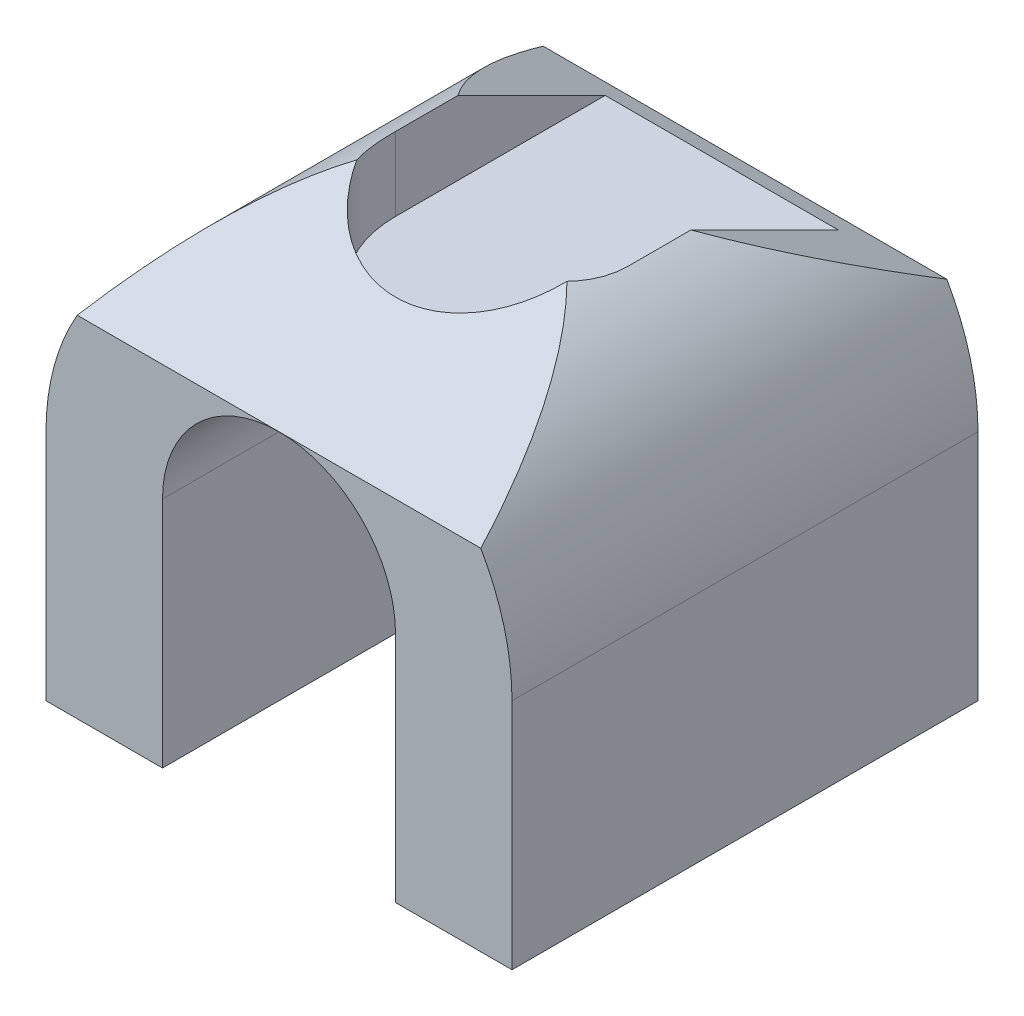
ISO-10303-21;
HEADER;
FILE_DESCRIPTION(('STEP AP214'),'2;1');
FILE_NAME('part.step','',(''),(''),'','','');
FILE_SCHEMA(('AUTOMOTIVE_DESIGN { 1 0 10303 214 1 1 1 1 }'));
ENDSEC;
DATA;
#1=APPLICATION_CONTEXT('core data for automotive mechanical design processes');
#2=APPLICATION_PROTOCOL_DEFINITION('international standard','automotive_design',2000,#1);
#3=PRODUCT_CONTEXT('',#1,'mechanical');
#4=PRODUCT('Part','Part','',(#3));
#5=PRODUCT_RELATED_PRODUCT_CATEGORY('part','',(#4));
#6=PRODUCT_DEFINITION_FORMATION('','',#4);
#7=PRODUCT_DEFINITION_CONTEXT('part definition',#1,'design');
#8=PRODUCT_DEFINITION('design','',#6,#7);
#9=PRODUCT_DEFINITION_SHAPE('','',#8);
#10=(LENGTH_UNIT() NAMED_UNIT(*) SI_UNIT(.MILLI.,.METRE.));
#11=(NAMED_UNIT(*) PLANE_ANGLE_UNIT() SI_UNIT($,.RADIAN.));
#12=(NAMED_UNIT(*) SI_UNIT($,.STERADIAN.) SOLID_ANGLE_UNIT());
#13=UNCERTAINTY_MEASURE_WITH_UNIT(LENGTH_MEASURE(1.E-05),#10,'distance_accuracy_value','');
#14=(GEOMETRIC_REPRESENTATION_CONTEXT(3) GLOBAL_UNCERTAINTY_ASSIGNED_CONTEXT((#13)) GLOBAL_UNIT_ASSIGNED_CONTEXT((#10,
#11,#12)) REPRESENTATION_CONTEXT('',''));
#15=CARTESIAN_POINT('',(0.,0.,0.));
#16=DIRECTION('',(0.,0.,1.));
#17=DIRECTION('',(1.,0.,0.));
#18=AXIS2_PLACEMENT_3D('',#15,#16,#17);
#19=CARTESIAN_POINT('',(-2.,4.,-2.));
#20=DIRECTION('',(0.,0.,1.));
#21=DIRECTION('',(1.,0.,0.));
#22=AXIS2_PLACEMENT_3D('',#19,#20,#21);
#23=PLANE('',#22);
#24=DIRECTION('',(0.,-1.,0.));
#25=VECTOR('',#24,1.);
#26=CARTESIAN_POINT('',(-2.,4.,-2.));
#27=LINE('',#26,#25);
#28=CARTESIAN_POINT('',(-2.,2.,-2.));
#29=VERTEX_POINT('',#28);
#30=CARTESIAN_POINT('',(-2.,0.,-2.));
#31=VERTEX_POINT('',#30);
#32=EDGE_CURVE('E343',#29,#31,#27,.T.);
#33=ORIENTED_EDGE('',*,*,#32,.F.);
#34=CARTESIAN_POINT('',(0.,2.,-2.));
#35=DIRECTION('',(0.,0.,1.));
#36=DIRECTION('',(1.,0.,0.));
#37=AXIS2_PLACEMENT_3D('',#34,#35,#36);
#38=CIRCLE('',#37,2.);
#39=CARTESIAN_POINT('',(-1.73205080756888,3.,-2.));
#40=VERTEX_POINT('',#39);
#41=EDGE_CURVE('E284',#29,#40,#38,.F.);
#42=ORIENTED_EDGE('',*,*,#41,.T.);
#43=DIRECTION('',(-1.,0.,0.));
#44=VECTOR('',#43,1.);
#45=CARTESIAN_POINT('',(8.,3.,-2.));
#46=LINE('',#45,#44);
#47=CARTESIAN_POINT('',(0.,3.,-2.));
#48=VERTEX_POINT('',#47);
#49=EDGE_CURVE('E321',#48,#40,#46,.T.);
#50=ORIENTED_EDGE('',*,*,#49,.F.);
#51=CARTESIAN_POINT('',(0.,2.,-2.));
#52=DIRECTION('',(0.,0.,1.));
#53=DIRECTION('',(1.,0.,0.));
#54=AXIS2_PLACEMENT_3D('',#51,#52,#53);
#55=CIRCLE('',#54,1.);
#56=CARTESIAN_POINT('',(-1.,2.,-2.));
#57=VERTEX_POINT('',#56);
#58=EDGE_CURVE('E304',#48,#57,#55,.T.);
#59=ORIENTED_EDGE('',*,*,#58,.T.);
#60=DIRECTION('',(0.,1.,0.));
#61=VECTOR('',#60,1.);
#62=CARTESIAN_POINT('',(-1.,4.,-2.));
#63=LINE('',#62,#61);
#64=CARTESIAN_POINT('',(-1.,0.,-2.));
#65=VERTEX_POINT('',#64);
#66=EDGE_CURVE('E313',#65,#57,#63,.T.);
#67=ORIENTED_EDGE('',*,*,#66,.F.);
#68=DIRECTION('',(-1.,0.,0.));
#69=VECTOR('',#68,1.);
#70=CARTESIAN_POINT('',(-2.,0.,-2.));
#71=LINE('',#70,#69);
#72=EDGE_CURVE('E328',#65,#31,#71,.T.);
#73=ORIENTED_EDGE('',*,*,#72,.T.);
#74=EDGE_LOOP('',(#33,#42,#50,#59,#67,#73));
#75=FACE_BOUND('',#74,.T.);
#76=ADVANCED_FACE('F93',(#75),#23,.F.);
#77=CARTESIAN_POINT('',(-2.,4.,2.));
#78=DIRECTION('',(0.,0.,-1.));
#79=DIRECTION('',(-1.,0.,0.));
#80=AXIS2_PLACEMENT_3D('',#77,#78,#79);
#81=PLANE('',#80);
#82=DIRECTION('',(-1.,0.,0.));
#83=VECTOR('',#82,1.);
#84=CARTESIAN_POINT('',(8.,3.,2.));
#85=LINE('',#84,#83);
#86=CARTESIAN_POINT('',(0.,3.,2.));
#87=VERTEX_POINT('',#86);
#88=CARTESIAN_POINT('',(-1.73205080756888,3.,2.));
#89=VERTEX_POINT('',#88);
#90=EDGE_CURVE('E318',#87,#89,#85,.T.);
#91=ORIENTED_EDGE('',*,*,#90,.T.);
#92=CARTESIAN_POINT('',(0.,2.,2.));
#93=DIRECTION('',(0.,0.,1.));
#94=DIRECTION('',(1.,0.,0.));
#95=AXIS2_PLACEMENT_3D('',#92,#93,#94);
#96=CIRCLE('',#95,2.);
#97=CARTESIAN_POINT('',(-2.,2.,2.));
#98=VERTEX_POINT('',#97);
#99=EDGE_CURVE('E275',#98,#89,#96,.F.);
#100=ORIENTED_EDGE('',*,*,#99,.F.);
#101=DIRECTION('',(0.,-1.,0.));
#102=VECTOR('',#101,1.);
#103=CARTESIAN_POINT('',(-2.,4.,2.));
#104=LINE('',#103,#102);
#105=CARTESIAN_POINT('',(-2.,0.,2.));
#106=VERTEX_POINT('',#105);
#107=EDGE_CURVE('E341',#98,#106,#104,.T.);
#108=ORIENTED_EDGE('',*,*,#107,.T.);
#109=DIRECTION('',(1.,0.,0.));
#110=VECTOR('',#109,1.);
#111=CARTESIAN_POINT('',(-2.,0.,2.));
#112=LINE('',#111,#110);
#113=CARTESIAN_POINT('',(-1.,0.,2.));
#114=VERTEX_POINT('',#113);
#115=EDGE_CURVE('E336',#106,#114,#112,.T.);
#116=ORIENTED_EDGE('',*,*,#115,.T.);
#117=DIRECTION('',(0.,1.,0.));
#118=VECTOR('',#117,1.);
#119=CARTESIAN_POINT('',(-1.,0.,2.));
#120=LINE('',#119,#118);
#121=CARTESIAN_POINT('',(-1.,2.,2.));
#122=VERTEX_POINT('',#121);
#123=EDGE_CURVE('E298',#114,#122,#120,.T.);
#124=ORIENTED_EDGE('',*,*,#123,.T.);
#125=CARTESIAN_POINT('',(0.,2.,2.));
#126=DIRECTION('',(0.,0.,1.));
#127=DIRECTION('',(1.,0.,0.));
#128=AXIS2_PLACEMENT_3D('',#125,#126,#127);
#129=CIRCLE('',#128,1.);
#130=EDGE_CURVE('E295',#87,#122,#129,.T.);
#131=ORIENTED_EDGE('',*,*,#130,.F.);
#132=EDGE_LOOP('',(#91,#100,#108,#116,#124,#131));
#133=FACE_BOUND('',#132,.T.);
#134=ADVANCED_FACE('F366',(#133),#81,.F.);
#135=CARTESIAN_POINT('',(8.,3.2,-1.6));
#136=DIRECTION('',(0.,-0.894427190999916,0.447213595499958));
#137=DIRECTION('',(0.,-0.447213595499958,-0.894427190999916));
#138=AXIS2_PLACEMENT_3D('',#135,#136,#137);
#139=PLANE('',#138);
#140=CARTESIAN_POINT('',(0.,2.,-4.));
#141=DIRECTION('',(0.,-0.894427190999916,0.447213595499958));
#142=DIRECTION('',(0.,0.447213595499958,0.894427190999916));
#143=AXIS2_PLACEMENT_3D('',#140,#141,#142);
#144=ELLIPSE('',#143,4.47213595499958,2.);
#145=CARTESIAN_POINT('',(-1.,3.73205080756888,-0.535898384862244));
#146=VERTEX_POINT('',#145);
#147=EDGE_CURVE('E280',#40,#146,#144,.F.);
#148=ORIENTED_EDGE('',*,*,#147,.T.);
#149=DIRECTION('',(0.,-0.447213595499958,-0.894427190999916));
#150=VECTOR('',#149,1.);
#151=CARTESIAN_POINT('',(-1.,3.2,-1.6));
#152=LINE('',#151,#150);
#153=CARTESIAN_POINT('',(-1.,3.1,-1.8));
#154=VERTEX_POINT('',#153);
#155=EDGE_CURVE('E108',#146,#154,#152,.T.);
#156=ORIENTED_EDGE('',*,*,#155,.T.);
#157=DIRECTION('',(-1.,0.,0.));
#158=VECTOR('',#157,1.);
#159=CARTESIAN_POINT('',(8.,3.1,-1.8));
#160=LINE('',#159,#158);
#161=CARTESIAN_POINT('',(1.,3.1,-1.8));
#162=VERTEX_POINT('',#161);
#163=EDGE_CURVE('E12',#162,#154,#160,.T.);
#164=ORIENTED_EDGE('',*,*,#163,.F.);
#165=DIRECTION('',(0.,0.447213595499958,0.894427190999916));
#166=VECTOR('',#165,1.);
#167=CARTESIAN_POINT('',(1.,3.2,-1.6));
#168=LINE('',#167,#166);
#169=CARTESIAN_POINT('',(1.,3.73205080756888,-0.535898384862246));
#170=VERTEX_POINT('',#169);
#171=EDGE_CURVE('E225',#162,#170,#168,.T.);
#172=ORIENTED_EDGE('',*,*,#171,.T.);
#173=CARTESIAN_POINT('',(0.,2.,-4.));
#174=DIRECTION('',(0.,-0.894427190999916,0.447213595499958));
#175=DIRECTION('',(0.,0.447213595499958,0.894427190999916));
#176=AXIS2_PLACEMENT_3D('',#173,#174,#175);
#177=ELLIPSE('',#176,4.47213595499958,2.);
#178=CARTESIAN_POINT('',(1.73205080756888,3.,-2.));
#179=VERTEX_POINT('',#178);
#180=EDGE_CURVE('E270',#170,#179,#177,.F.);
#181=ORIENTED_EDGE('',*,*,#180,.T.);
#182=EDGE_CURVE('E324',#179,#48,#46,.T.);
#183=ORIENTED_EDGE('',*,*,#182,.T.);
#184=ORIENTED_EDGE('',*,*,#49,.T.);
#185=EDGE_LOOP('',(#148,#156,#164,#172,#181,#183,#184));
#186=FACE_BOUND('',#185,.T.);
#187=ADVANCED_FACE('F273',(#186),#139,.F.);
#188=CARTESIAN_POINT('',(2.,4.,2.));
#189=DIRECTION('',(-1.,0.,0.));
#190=DIRECTION('',(0.,0.,1.));
#191=AXIS2_PLACEMENT_3D('',#188,#189,#190);
#192=PLANE('',#191);
#193=DIRECTION('',(0.,0.,1.));
#194=VECTOR('',#193,1.);
#195=CARTESIAN_POINT('',(2.,2.,-8.));
#196=LINE('',#195,#194);
#197=CARTESIAN_POINT('',(2.,2.,-2.));
#198=VERTEX_POINT('',#197);
#199=CARTESIAN_POINT('',(2.,2.,2.));
#200=VERTEX_POINT('',#199);
#201=EDGE_CURVE('E289',#198,#200,#196,.T.);
#202=ORIENTED_EDGE('',*,*,#201,.T.);
#203=DIRECTION('',(0.,-1.,0.));
#204=VECTOR('',#203,1.);
#205=CARTESIAN_POINT('',(2.,4.,2.));
#206=LINE('',#205,#204);
#207=CARTESIAN_POINT('',(2.,0.,2.));
#208=VERTEX_POINT('',#207);
#209=EDGE_CURVE('E339',#200,#208,#206,.T.);
#210=ORIENTED_EDGE('',*,*,#209,.T.);
#211=DIRECTION('',(0.,0.,-1.));
#212=VECTOR('',#211,1.);
#213=CARTESIAN_POINT('',(2.,0.,2.));
#214=LINE('',#213,#212);
#215=CARTESIAN_POINT('',(2.,0.,-2.));
#216=VERTEX_POINT('',#215);
#217=EDGE_CURVE('E325',#208,#216,#214,.T.);
#218=ORIENTED_EDGE('',*,*,#217,.T.);
#219=DIRECTION('',(0.,-1.,0.));
#220=VECTOR('',#219,1.);
#221=CARTESIAN_POINT('',(2.,4.,-2.));
#222=LINE('',#221,#220);
#223=EDGE_CURVE('E345',#198,#216,#222,.T.);
#224=ORIENTED_EDGE('',*,*,#223,.F.);
#225=EDGE_LOOP('',(#202,#210,#218,#224));
#226=FACE_BOUND('',#225,.T.);
#227=ADVANCED_FACE('F95',(#226),#192,.F.);
#228=CARTESIAN_POINT('',(0.,0.,0.));
#229=DIRECTION('',(0.,-1.,0.));
#230=DIRECTION('',(0.,0.,-1.));
#231=AXIS2_PLACEMENT_3D('',#228,#229,#230);
#232=PLANE('',#231);
#233=ORIENTED_EDGE('',*,*,#72,.F.);
#234=DIRECTION('',(0.,0.,1.));
#235=VECTOR('',#234,1.);
#236=CARTESIAN_POINT('',(-1.,0.,0.));
#237=LINE('',#236,#235);
#238=EDGE_CURVE('E349',#65,#114,#237,.T.);
#239=ORIENTED_EDGE('',*,*,#238,.T.);
#240=ORIENTED_EDGE('',*,*,#115,.F.);
#241=DIRECTION('',(0.,0.,1.));
#242=VECTOR('',#241,1.);
#243=CARTESIAN_POINT('',(-2.,0.,2.));
#244=LINE('',#243,#242);
#245=EDGE_CURVE('E332',#31,#106,#244,.T.);
#246=ORIENTED_EDGE('',*,*,#245,.F.);
#247=EDGE_LOOP('',(#233,#239,#240,#246));
#248=FACE_BOUND('',#247,.T.);
#249=ADVANCED_FACE('F400',(#248),#232,.T.);
#250=ORIENTED_EDGE('',*,*,#182,.F.);
#251=CARTESIAN_POINT('',(0.,2.,-2.));
#252=DIRECTION('',(0.,0.,1.));
#253=DIRECTION('',(1.,0.,0.));
#254=AXIS2_PLACEMENT_3D('',#251,#252,#253);
#255=CIRCLE('',#254,2.);
#256=EDGE_CURVE('E310',#179,#198,#255,.F.);
#257=ORIENTED_EDGE('',*,*,#256,.T.);
#258=ORIENTED_EDGE('',*,*,#223,.T.);
#259=CARTESIAN_POINT('',(1.,0.,-2.));
#260=VERTEX_POINT('',#259);
#261=EDGE_CURVE('E329',#216,#260,#71,.T.);
#262=ORIENTED_EDGE('',*,*,#261,.T.);
#263=DIRECTION('',(0.,1.,0.));
#264=VECTOR('',#263,1.);
#265=CARTESIAN_POINT('',(0.999999999999998,4.,-2.));
#266=LINE('',#265,#264);
#267=CARTESIAN_POINT('',(0.999999999999999,2.,-2.));
#268=VERTEX_POINT('',#267);
#269=EDGE_CURVE('E315',#260,#268,#266,.T.);
#270=ORIENTED_EDGE('',*,*,#269,.T.);
#271=EDGE_CURVE('E308',#268,#48,#55,.T.);
#272=ORIENTED_EDGE('',*,*,#271,.T.);
#273=EDGE_LOOP('',(#250,#257,#258,#262,#270,#272));
#274=FACE_BOUND('',#273,.T.);
#275=ADVANCED_FACE('F384',(#274),#23,.F.);
#276=CARTESIAN_POINT('',(-2.,4.,2.));
#277=DIRECTION('',(1.,0.,0.));
#278=DIRECTION('',(0.,0.,-1.));
#279=AXIS2_PLACEMENT_3D('',#276,#277,#278);
#280=PLANE('',#279);
#281=ORIENTED_EDGE('',*,*,#107,.F.);
#282=DIRECTION('',(0.,0.,1.));
#283=VECTOR('',#282,1.);
#284=CARTESIAN_POINT('',(-2.,2.,-8.));
#285=LINE('',#284,#283);
#286=EDGE_CURVE('E276',#29,#98,#285,.T.);
#287=ORIENTED_EDGE('',*,*,#286,.F.);
#288=ORIENTED_EDGE('',*,*,#32,.T.);
#289=ORIENTED_EDGE('',*,*,#245,.T.);
#290=EDGE_LOOP('',(#281,#287,#288,#289));
#291=FACE_BOUND('',#290,.T.);
#292=ADVANCED_FACE('F362',(#291),#280,.F.);
#293=ORIENTED_EDGE('',*,*,#209,.F.);
#294=CARTESIAN_POINT('',(0.,2.,2.));
#295=DIRECTION('',(0.,0.,1.));
#296=DIRECTION('',(1.,0.,0.));
#297=AXIS2_PLACEMENT_3D('',#294,#295,#296);
#298=CIRCLE('',#297,2.);
#299=CARTESIAN_POINT('',(1.73205080756888,3.,2.));
#300=VERTEX_POINT('',#299);
#301=EDGE_CURVE('E287',#300,#200,#298,.F.);
#302=ORIENTED_EDGE('',*,*,#301,.F.);
#303=EDGE_CURVE('E320',#300,#87,#85,.T.);
#304=ORIENTED_EDGE('',*,*,#303,.T.);
#305=CARTESIAN_POINT('',(0.999999999999999,2.,2.));
#306=VERTEX_POINT('',#305);
#307=EDGE_CURVE('E296',#306,#87,#129,.T.);
#308=ORIENTED_EDGE('',*,*,#307,.F.);
#309=DIRECTION('',(0.,1.,0.));
#310=VECTOR('',#309,1.);
#311=CARTESIAN_POINT('',(1.,0.,2.));
#312=LINE('',#311,#310);
#313=CARTESIAN_POINT('',(1.,0.,2.));
#314=VERTEX_POINT('',#313);
#315=EDGE_CURVE('E292',#314,#306,#312,.T.);
#316=ORIENTED_EDGE('',*,*,#315,.F.);
#317=EDGE_CURVE('E335',#314,#208,#112,.T.);
#318=ORIENTED_EDGE('',*,*,#317,.T.);
#319=EDGE_LOOP('',(#293,#302,#304,#308,#316,#318));
#320=FACE_BOUND('',#319,.T.);
#321=ADVANCED_FACE('F376',(#320),#81,.F.);
#322=DIRECTION('',(0.,0.,1.));
#323=VECTOR('',#322,1.);
#324=CARTESIAN_POINT('',(1.,0.,0.));
#325=LINE('',#324,#323);
#326=EDGE_CURVE('E352',#260,#314,#325,.T.);
#327=ORIENTED_EDGE('',*,*,#326,.F.);
#328=ORIENTED_EDGE('',*,*,#261,.F.);
#329=ORIENTED_EDGE('',*,*,#217,.F.);
#330=ORIENTED_EDGE('',*,*,#317,.F.);
#331=EDGE_LOOP('',(#327,#328,#329,#330));
#332=FACE_BOUND('',#331,.T.);
#333=ADVANCED_FACE('F387',(#332),#232,.T.);
#334=CARTESIAN_POINT('',(8.,3.2,1.6));
#335=DIRECTION('',(0.,-0.894427190999916,-0.447213595499958));
#336=DIRECTION('',(0.,0.447213595499958,-0.894427190999916));
#337=AXIS2_PLACEMENT_3D('',#334,#335,#336);
#338=PLANE('',#337);
#339=CARTESIAN_POINT('',(0.,2.,4.));
#340=DIRECTION('',(0.,-0.894427190999916,-0.447213595499958));
#341=DIRECTION('',(0.,-0.447213595499958,0.894427190999916));
#342=AXIS2_PLACEMENT_3D('',#339,#340,#341);
#343=ELLIPSE('',#342,4.47213595499958,2.);
#344=CARTESIAN_POINT('',(0.902590160287692,3.78474956297847,0.430500874043064));
#345=VERTEX_POINT('',#344);
#346=EDGE_CURVE('E347',#300,#345,#343,.F.);
#347=ORIENTED_EDGE('',*,*,#346,.T.);
#348=CARTESIAN_POINT('',(0.,4.,0.));
#349=DIRECTION('',(0.,-0.894427190999916,-0.447213595499958));
#350=DIRECTION('',(0.,0.447213595499958,-0.894427190999916));
#351=AXIS2_PLACEMENT_3D('',#348,#349,#350);
#352=ELLIPSE('',#351,1.11803398874989,1.);
#353=CARTESIAN_POINT('',(-0.902590160287692,3.78474956297847,0.430500874043061));
#354=VERTEX_POINT('',#353);
#355=EDGE_CURVE('E236',#345,#354,#352,.T.);
#356=ORIENTED_EDGE('',*,*,#355,.T.);
#357=CARTESIAN_POINT('',(0.,2.,4.));
#358=DIRECTION('',(0.,-0.894427190999916,-0.447213595499958));
#359=DIRECTION('',(0.,-0.447213595499958,0.894427190999916));
#360=AXIS2_PLACEMENT_3D('',#357,#358,#359);
#361=ELLIPSE('',#360,4.47213595499958,2.);
#362=EDGE_CURVE('E116',#354,#89,#361,.F.);
#363=ORIENTED_EDGE('',*,*,#362,.T.);
#364=ORIENTED_EDGE('',*,*,#90,.F.);
#365=ORIENTED_EDGE('',*,*,#303,.F.);
#366=EDGE_LOOP('',(#347,#356,#363,#364,#365));
#367=FACE_BOUND('',#366,.T.);
#368=ADVANCED_FACE('F371',(#367),#338,.F.);
#369=CARTESIAN_POINT('',(0.,2.,-8.));
#370=DIRECTION('',(0.,0.,1.));
#371=DIRECTION('',(1.,0.,0.));
#372=AXIS2_PLACEMENT_3D('',#369,#370,#371);
#373=CYLINDRICAL_SURFACE('',#372,2.);
#374=DIRECTION('',(0.,0.,1.));
#375=VECTOR('',#374,1.);
#376=CARTESIAN_POINT('',(1.,3.73205080756888,-8.));
#377=LINE('',#376,#375);
#378=CARTESIAN_POINT('',(1.,3.73205080756888,0.));
#379=VERTEX_POINT('',#378);
#380=EDGE_CURVE('E101',#170,#379,#377,.T.);
#381=ORIENTED_EDGE('',*,*,#380,.T.);
#382=CARTESIAN_POINT('',(1.,3.73205080756888,0.));
#383=CARTESIAN_POINT('',(1.00000195137527,3.73204560547661,0.0261972520352561));
#384=CARTESIAN_POINT('',(0.998969890365785,3.73264589074899,0.0523796193393224));
#385=CARTESIAN_POINT('',(0.994866582729859,3.73500693547265,0.10451562976441));
#386=CARTESIAN_POINT('',(0.991796589375349,3.73676698169817,0.130469403530703));
#387=CARTESIAN_POINT('',(0.979625421921302,3.74368133316507,0.207394147212922));
#388=CARTESIAN_POINT('',(0.967562154832119,3.75047121792653,0.257783077372897));
#389=CARTESIAN_POINT('',(0.936112148255902,3.76748616839516,0.355424985722331));
#390=CARTESIAN_POINT('',(0.916740149961811,3.77770431497795,0.402684052566709));
#391=CARTESIAN_POINT('',(0.871308099714303,3.80040740132325,0.493353593991553));
#392=CARTESIAN_POINT('',(0.845237343062601,3.81289595980251,0.536757757599596));
#393=CARTESIAN_POINT('',(0.784663080693048,3.83997018247363,0.622311546260746));
#394=CARTESIAN_POINT('',(0.749644406172151,3.8546438235589,0.664068491857542));
#395=CARTESIAN_POINT('',(0.673244776834064,3.88372298199301,0.74141589913186));
#396=CARTESIAN_POINT('',(0.631862045520576,3.89812842321248,0.77700463306393));
#397=CARTESIAN_POINT('',(0.540469897884267,3.92622083061797,0.843381512931065));
#398=CARTESIAN_POINT('',(0.490065310362353,3.93979240973207,0.873678944594266));
#399=CARTESIAN_POINT('',(0.384109834198184,3.96351616676258,0.925158968529046));
#400=CARTESIAN_POINT('',(0.328566613407682,3.97367333795893,0.946354883694276));
#401=CARTESIAN_POINT('',(0.224523798990683,3.98791771461899,0.97567818472854));
#402=CARTESIAN_POINT('',(0.176606359393242,3.99277751337371,0.985491669279944));
#403=CARTESIAN_POINT('',(0.103829958620148,3.99745240237257,0.994898234871283));
#404=CARTESIAN_POINT('',(0.0793722359955009,3.99857451325701,0.99714730508048));
#405=CARTESIAN_POINT('',(0.0303227514611769,3.99992108024093,0.999842181649924));
#406=CARTESIAN_POINT('',(0.00573093692192345,4.00014515399516,1.00028721993255));
#407=CARTESIAN_POINT('',(-0.018849276866289,3.9999111742179,0.999822336598667));
#408=B_SPLINE_CURVE_WITH_KNOTS('',3,(#382,#383,#384,#385,#386,#387,#388,#389,#390,#391,#392,
#393,#394,#395,#396,#397,#398,#399,#400,#401,#402,#403,#404,#405,#406,#407),.UNSPECIFIED.,.F.,
.F.,(4,2,2,2,2,2,2,2,2,2,2,2,4),(0.,0.0785362457848689,0.157024238642518,0.312951878705677,
0.468566690605075,0.624431740457373,0.793039657549001,0.961694726461857,1.1418133008816,
1.32166730954749,1.46845894528665,1.54214451358215,1.61586145066592),.UNSPECIFIED.);
#409=EDGE_CURVE('E215',#379,#345,#408,.T.);
#410=ORIENTED_EDGE('',*,*,#409,.T.);
#411=ORIENTED_EDGE('',*,*,#346,.F.);
#412=ORIENTED_EDGE('',*,*,#301,.T.);
#413=ORIENTED_EDGE('',*,*,#201,.F.);
#414=ORIENTED_EDGE('',*,*,#256,.F.);
#415=ORIENTED_EDGE('',*,*,#180,.F.);
#416=EDGE_LOOP('',(#381,#410,#411,#412,#413,#414,#415));
#417=FACE_BOUND('',#416,.T.);
#418=ADVANCED_FACE('F245',(#417),#373,.T.);
#419=CARTESIAN_POINT('',(1.,0.,-8.));
#420=DIRECTION('',(1.,0.,0.));
#421=DIRECTION('',(0.,1.,0.));
#422=AXIS2_PLACEMENT_3D('',#419,#420,#421);
#423=PLANE('',#422);
#424=ORIENTED_EDGE('',*,*,#326,.T.);
#425=ORIENTED_EDGE('',*,*,#315,.T.);
#426=DIRECTION('',(0.,0.,1.));
#427=VECTOR('',#426,1.);
#428=CARTESIAN_POINT('',(0.999999999999999,2.,-8.));
#429=LINE('',#428,#427);
#430=EDGE_CURVE('E301',#268,#306,#429,.T.);
#431=ORIENTED_EDGE('',*,*,#430,.F.);
#432=ORIENTED_EDGE('',*,*,#269,.F.);
#433=EDGE_LOOP('',(#424,#425,#431,#432));
#434=FACE_BOUND('',#433,.T.);
#435=ADVANCED_FACE('F390',(#434),#423,.F.);
#436=CARTESIAN_POINT('',(-1.,0.,-8.));
#437=DIRECTION('',(1.,0.,0.));
#438=DIRECTION('',(0.,1.,0.));
#439=AXIS2_PLACEMENT_3D('',#436,#437,#438);
#440=PLANE('',#439);
#441=ORIENTED_EDGE('',*,*,#66,.T.);
#442=DIRECTION('',(0.,0.,1.));
#443=VECTOR('',#442,1.);
#444=CARTESIAN_POINT('',(-1.,2.,-8.));
#445=LINE('',#444,#443);
#446=EDGE_CURVE('E302',#57,#122,#445,.T.);
#447=ORIENTED_EDGE('',*,*,#446,.T.);
#448=ORIENTED_EDGE('',*,*,#123,.F.);
#449=ORIENTED_EDGE('',*,*,#238,.F.);
#450=EDGE_LOOP('',(#441,#447,#448,#449));
#451=FACE_BOUND('',#450,.T.);
#452=ADVANCED_FACE('F397',(#451),#440,.T.);
#453=CARTESIAN_POINT('',(0.,2.,-8.));
#454=DIRECTION('',(0.,0.,1.));
#455=DIRECTION('',(1.,0.,0.));
#456=AXIS2_PLACEMENT_3D('',#453,#454,#455);
#457=CYLINDRICAL_SURFACE('',#456,1.);
#458=ORIENTED_EDGE('',*,*,#430,.T.);
#459=ORIENTED_EDGE('',*,*,#307,.T.);
#460=ORIENTED_EDGE('',*,*,#130,.T.);
#461=ORIENTED_EDGE('',*,*,#446,.F.);
#462=ORIENTED_EDGE('',*,*,#58,.F.);
#463=ORIENTED_EDGE('',*,*,#271,.F.);
#464=EDGE_LOOP('',(#458,#459,#460,#461,#462,#463));
#465=FACE_BOUND('',#464,.T.);
#466=ADVANCED_FACE('F394',(#465),#457,.F.);
#467=CARTESIAN_POINT('',(0.,2.,-8.));
#468=DIRECTION('',(0.,0.,1.));
#469=DIRECTION('',(1.,0.,0.));
#470=AXIS2_PLACEMENT_3D('',#467,#468,#469);
#471=CYLINDRICAL_SURFACE('',#470,2.);
#472=ORIENTED_EDGE('',*,*,#362,.F.);
#473=CARTESIAN_POINT('',(0.0188492768662874,3.9999111742179,0.999822336598667));
#474=CARTESIAN_POINT('',(-0.0074365042730844,4.00016157321062,1.00031927050714));
#475=CARTESIAN_POINT('',(-0.0337332138567843,3.99988790373493,0.999775953163634));
#476=CARTESIAN_POINT('',(-0.0861624959720326,3.99831481998451,0.996627066975756));
#477=CARTESIAN_POINT('',(-0.112295125398594,3.99701578360206,0.994022257879792));
#478=CARTESIAN_POINT('',(-0.189918612850001,3.99163319485549,0.983181255175342));
#479=CARTESIAN_POINT('',(-0.240920786729468,3.98606631309525,0.971923311837361));
#480=CARTESIAN_POINT('',(-0.340021215789718,3.97152214149368,0.941844275945984));
#481=CARTESIAN_POINT('',(-0.388122246911061,3.9625481736797,0.923030549514155));
#482=CARTESIAN_POINT('',(-0.480461174145418,3.94200850510889,0.878514022750611));
#483=CARTESIAN_POINT('',(-0.524695355935765,3.93044034969716,0.85280469316077));
#484=CARTESIAN_POINT('',(-0.61083321553593,3.90499720243754,0.793580261804522));
#485=CARTESIAN_POINT('',(-0.652459680848192,3.89102821795682,0.759703326742522));
#486=CARTESIAN_POINT('',(-0.729722278563864,3.86257978441686,0.685832226428549));
#487=CARTESIAN_POINT('',(-0.765353387039751,3.84809991942385,0.645832983933718));
#488=CARTESIAN_POINT('',(-0.832617651422835,3.81884666457437,0.556875791871321));
#489=CARTESIAN_POINT('',(-0.863667811626427,3.80414988020787,0.50744850627126));
#490=CARTESIAN_POINT('',(-0.916886904145302,3.77769669434928,0.403388984390545));
#491=CARTESIAN_POINT('',(-0.939073781265645,3.76593437001048,0.348767544930852));
#492=CARTESIAN_POINT('',(-0.970641995009035,3.74874856157402,0.245446964737625));
#493=CARTESIAN_POINT('',(-0.981571283279799,3.74258198705685,0.197349537862341));
#494=CARTESIAN_POINT('',(-0.992585806227006,3.73631502269448,0.124056414541171));
#495=CARTESIAN_POINT('',(-0.995360896039203,3.73472295817944,0.0993665820574211));
#496=CARTESIAN_POINT('',(-0.999069544308742,3.73258827975699,0.0497884363864104));
#497=CARTESIAN_POINT('',(-1.00000192716496,3.73204633580465,0.0249000066568142));
#498=CARTESIAN_POINT('',(-1.,3.73205080756888,0.));
#499=B_SPLINE_CURVE_WITH_KNOTS('',3,(#473,#474,#475,#476,#477,#478,#479,#480,#481,#482,#483,
#484,#485,#486,#487,#488,#489,#490,#491,#492,#493,#494,#495,#496,#497,#498),.UNSPECIFIED.,.F.,
.F.,(4,2,2,2,2,2,2,2,2,2,2,2,4),(0.,0.0788227956394872,0.157616555207376,0.314358578502549,
0.470948163739256,0.627686546035379,0.793372973244945,0.959197556586323,1.13888078523358,
1.31819835662217,1.46661168025609,1.54121875922018,1.61587342029675),.UNSPECIFIED.);
#500=CARTESIAN_POINT('',(-1.,3.73205080756888,0.));
#501=VERTEX_POINT('',#500);
#502=EDGE_CURVE('E258',#354,#501,#499,.T.);
#503=ORIENTED_EDGE('',*,*,#502,.T.);
#504=DIRECTION('',(0.,0.,1.));
#505=VECTOR('',#504,1.);
#506=CARTESIAN_POINT('',(-1.,3.73205080756888,-8.));
#507=LINE('',#506,#505);
#508=EDGE_CURVE('E264',#501,#146,#507,.F.);
#509=ORIENTED_EDGE('',*,*,#508,.T.);
#510=ORIENTED_EDGE('',*,*,#147,.F.);
#511=ORIENTED_EDGE('',*,*,#41,.F.);
#512=ORIENTED_EDGE('',*,*,#286,.T.);
#513=ORIENTED_EDGE('',*,*,#99,.T.);
#514=EDGE_LOOP('',(#472,#503,#509,#510,#511,#512,#513));
#515=FACE_BOUND('',#514,.T.);
#516=ADVANCED_FACE('F254',(#515),#471,.T.);
#517=CARTESIAN_POINT('',(0.,3.1,0.));
#518=DIRECTION('',(0.,1.,0.));
#519=DIRECTION('',(0.,0.,1.));
#520=AXIS2_PLACEMENT_3D('',#517,#518,#519);
#521=PLANE('',#520);
#522=ORIENTED_EDGE('',*,*,#163,.T.);
#523=DIRECTION('',(0.,0.,1.));
#524=VECTOR('',#523,1.);
#525=CARTESIAN_POINT('',(-1.,3.1,0.));
#526=LINE('',#525,#524);
#527=CARTESIAN_POINT('',(-1.,3.1,0.));
#528=VERTEX_POINT('',#527);
#529=EDGE_CURVE('E219',#154,#528,#526,.T.);
#530=ORIENTED_EDGE('',*,*,#529,.T.);
#531=CARTESIAN_POINT('',(0.,3.1,0.));
#532=DIRECTION('',(0.,1.,0.));
#533=DIRECTION('',(0.,0.,1.));
#534=AXIS2_PLACEMENT_3D('',#531,#532,#533);
#535=CIRCLE('',#534,1.);
#536=CARTESIAN_POINT('',(1.,3.1,0.));
#537=VERTEX_POINT('',#536);
#538=EDGE_CURVE('E213',#528,#537,#535,.T.);
#539=ORIENTED_EDGE('',*,*,#538,.T.);
#540=DIRECTION('',(0.,0.,-1.));
#541=VECTOR('',#540,1.);
#542=CARTESIAN_POINT('',(1.,3.1,0.));
#543=LINE('',#542,#541);
#544=EDGE_CURVE('E222',#537,#162,#543,.T.);
#545=ORIENTED_EDGE('',*,*,#544,.T.);
#546=EDGE_LOOP('',(#522,#530,#539,#545));
#547=FACE_BOUND('',#546,.T.);
#548=ADVANCED_FACE('F229',(#547),#521,.T.);
#549=CARTESIAN_POINT('',(1.,3.1,0.));
#550=DIRECTION('',(1.,0.,0.));
#551=DIRECTION('',(0.,0.,-1.));
#552=AXIS2_PLACEMENT_3D('',#549,#550,#551);
#553=PLANE('',#552);
#554=ORIENTED_EDGE('',*,*,#544,.F.);
#555=DIRECTION('',(0.,1.,0.));
#556=VECTOR('',#555,1.);
#557=CARTESIAN_POINT('',(1.,3.1,0.));
#558=LINE('',#557,#556);
#559=EDGE_CURVE('E208',#537,#379,#558,.T.);
#560=ORIENTED_EDGE('',*,*,#559,.T.);
#561=ORIENTED_EDGE('',*,*,#380,.F.);
#562=ORIENTED_EDGE('',*,*,#171,.F.);
#563=EDGE_LOOP('',(#554,#560,#561,#562));
#564=FACE_BOUND('',#563,.T.);
#565=ADVANCED_FACE('F223',(#564),#553,.F.);
#566=CARTESIAN_POINT('',(0.,3.1,0.));
#567=DIRECTION('',(0.,1.,0.));
#568=DIRECTION('',(0.,0.,1.));
#569=AXIS2_PLACEMENT_3D('',#566,#567,#568);
#570=CYLINDRICAL_SURFACE('',#569,1.);
#571=ORIENTED_EDGE('',*,*,#559,.F.);
#572=ORIENTED_EDGE('',*,*,#538,.F.);
#573=DIRECTION('',(0.,1.,0.));
#574=VECTOR('',#573,1.);
#575=CARTESIAN_POINT('',(-1.,3.1,0.));
#576=LINE('',#575,#574);
#577=EDGE_CURVE('E218',#528,#501,#576,.T.);
#578=ORIENTED_EDGE('',*,*,#577,.T.);
#579=ORIENTED_EDGE('',*,*,#502,.F.);
#580=ORIENTED_EDGE('',*,*,#355,.F.);
#581=ORIENTED_EDGE('',*,*,#409,.F.);
#582=EDGE_LOOP('',(#571,#572,#578,#579,#580,#581));
#583=FACE_BOUND('',#582,.T.);
#584=ADVANCED_FACE('F210',(#583),#570,.F.);
#585=CARTESIAN_POINT('',(-1.,3.1,0.));
#586=DIRECTION('',(-1.,0.,0.));
#587=DIRECTION('',(0.,0.,1.));
#588=AXIS2_PLACEMENT_3D('',#585,#586,#587);
#589=PLANE('',#588);
#590=ORIENTED_EDGE('',*,*,#508,.F.);
#591=ORIENTED_EDGE('',*,*,#577,.F.);
#592=ORIENTED_EDGE('',*,*,#529,.F.);
#593=ORIENTED_EDGE('',*,*,#155,.F.);
#594=EDGE_LOOP('',(#590,#591,#592,#593));
#595=FACE_BOUND('',#594,.T.);
#596=ADVANCED_FACE('F252',(#595),#589,.F.);
#597=CLOSED_SHELL('',(#76,#134,#187,#227,#249,#275,#292,#321,#333,#368,#418,#435,#452,#466,#516,
#548,#565,#584,#596));
#598=MANIFOLD_SOLID_BREP('B2',#597);
#599=ADVANCED_BREP_SHAPE_REPRESENTATION('',(#18,#598),#14);
#600=SHAPE_DEFINITION_REPRESENTATION(#9,#599);
ENDSEC;
END-ISO-10303-21;
